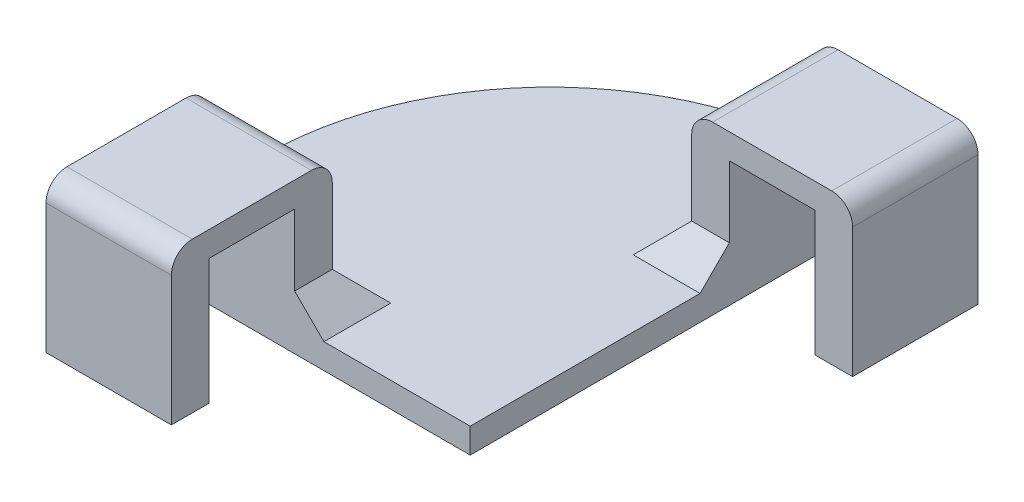
ISO-10303-21;
HEADER;
FILE_DESCRIPTION(('STEP AP214'),'2;1');
FILE_NAME('part.step','',(''),(''),'','','');
FILE_SCHEMA(('AUTOMOTIVE_DESIGN { 1 0 10303 214 1 1 1 1 }'));
ENDSEC;
DATA;
#1=APPLICATION_CONTEXT('core data for automotive mechanical design processes');
#2=APPLICATION_PROTOCOL_DEFINITION('international standard','automotive_design',2000,#1);
#3=PRODUCT_CONTEXT('',#1,'mechanical');
#4=PRODUCT('Part','Part','',(#3));
#5=PRODUCT_RELATED_PRODUCT_CATEGORY('part','',(#4));
#6=PRODUCT_DEFINITION_FORMATION('','',#4);
#7=PRODUCT_DEFINITION_CONTEXT('part definition',#1,'design');
#8=PRODUCT_DEFINITION('design','',#6,#7);
#9=PRODUCT_DEFINITION_SHAPE('','',#8);
#10=(LENGTH_UNIT() NAMED_UNIT(*) SI_UNIT(.MILLI.,.METRE.));
#11=(NAMED_UNIT(*) PLANE_ANGLE_UNIT() SI_UNIT($,.RADIAN.));
#12=(NAMED_UNIT(*) SI_UNIT($,.STERADIAN.) SOLID_ANGLE_UNIT());
#13=UNCERTAINTY_MEASURE_WITH_UNIT(LENGTH_MEASURE(1.E-05),#10,'distance_accuracy_value','');
#14=(GEOMETRIC_REPRESENTATION_CONTEXT(3) GLOBAL_UNCERTAINTY_ASSIGNED_CONTEXT((#13)) GLOBAL_UNIT_ASSIGNED_CONTEXT((#10,
#11,#12)) REPRESENTATION_CONTEXT('',''));
#15=CARTESIAN_POINT('',(0.,0.,0.));
#16=DIRECTION('',(0.,0.,1.));
#17=DIRECTION('',(1.,0.,0.));
#18=AXIS2_PLACEMENT_3D('',#15,#16,#17);
#19=CARTESIAN_POINT('',(0.,30.,0.));
#20=DIRECTION('',(0.,-1.,0.));
#21=DIRECTION('',(0.,0.,-1.));
#22=AXIS2_PLACEMENT_3D('',#19,#20,#21);
#23=PLANE('',#22);
#24=DIRECTION('',(1.,0.,0.));
#25=VECTOR('',#24,1.);
#26=CARTESIAN_POINT('',(1.41861830924324E-13,30.,-91.9999999999999));
#27=LINE('',#26,#25);
#28=CARTESIAN_POINT('',(0.,30.,-91.9999999999999));
#29=VERTEX_POINT('',#28);
#30=CARTESIAN_POINT('',(20.5000000000001,30.,-91.9999999999999));
#31=VERTEX_POINT('',#30);
#32=EDGE_CURVE('E271',#29,#31,#27,.T.);
#33=ORIENTED_EDGE('',*,*,#32,.T.);
#34=DIRECTION('',(0.,0.,-1.));
#35=VECTOR('',#34,1.);
#36=CARTESIAN_POINT('',(20.5000000000001,30.,0.));
#37=LINE('',#36,#35);
#38=CARTESIAN_POINT('',(20.5000000000001,30.,-62.0000000000001));
#39=VERTEX_POINT('',#38);
#40=EDGE_CURVE('E413',#39,#31,#37,.T.);
#41=ORIENTED_EDGE('',*,*,#40,.F.);
#42=DIRECTION('',(1.,0.,0.));
#43=VECTOR('',#42,1.);
#44=CARTESIAN_POINT('',(-3.8241015292644E-13,30.,-62.));
#45=LINE('',#44,#43);
#46=CARTESIAN_POINT('',(0.,30.,-62.));
#47=VERTEX_POINT('',#46);
#48=EDGE_CURVE('E280',#47,#39,#45,.T.);
#49=ORIENTED_EDGE('',*,*,#48,.F.);
#50=DIRECTION('',(0.,0.,-1.));
#51=VECTOR('',#50,1.);
#52=CARTESIAN_POINT('',(0.,30.,0.));
#53=LINE('',#52,#51);
#54=EDGE_CURVE('E302',#47,#29,#53,.T.);
#55=ORIENTED_EDGE('',*,*,#54,.T.);
#56=EDGE_LOOP('',(#33,#41,#49,#55));
#57=FACE_BOUND('',#56,.T.);
#58=ADVANCED_FACE('F35',(#57),#23,.T.);
#59=CARTESIAN_POINT('',(0.,6.,0.));
#60=DIRECTION('',(0.,0.,1.));
#61=DIRECTION('',(1.,0.,0.));
#62=AXIS2_PLACEMENT_3D('',#59,#60,#61);
#63=PLANE('',#62);
#64=DIRECTION('',(-1.,0.,0.));
#65=VECTOR('',#64,1.);
#66=CARTESIAN_POINT('',(0.,0.,0.));
#67=LINE('',#66,#65);
#68=CARTESIAN_POINT('',(0.,0.,0.));
#69=VERTEX_POINT('',#68);
#70=CARTESIAN_POINT('',(-80.7745184235845,0.,0.));
#71=VERTEX_POINT('',#70);
#72=EDGE_CURVE('E329',#69,#71,#67,.T.);
#73=ORIENTED_EDGE('',*,*,#72,.F.);
#74=DIRECTION('',(0.,-1.,0.));
#75=VECTOR('',#74,1.);
#76=CARTESIAN_POINT('',(0.,6.,0.));
#77=LINE('',#76,#75);
#78=CARTESIAN_POINT('',(0.,6.,0.));
#79=VERTEX_POINT('',#78);
#80=EDGE_CURVE('E367',#79,#69,#77,.T.);
#81=ORIENTED_EDGE('',*,*,#80,.F.);
#82=DIRECTION('',(-1.,0.,0.));
#83=VECTOR('',#82,1.);
#84=CARTESIAN_POINT('',(0.,6.,0.));
#85=LINE('',#84,#83);
#86=CARTESIAN_POINT('',(-34.9999999999999,6.,0.));
#87=VERTEX_POINT('',#86);
#88=EDGE_CURVE('E330',#79,#87,#85,.T.);
#89=ORIENTED_EDGE('',*,*,#88,.T.);
#90=DIRECTION('',(-0.707106781186553,0.707106781186543,0.));
#91=VECTOR('',#90,1.);
#92=CARTESIAN_POINT('',(-41.9999999999999,13.,0.));
#93=LINE('',#92,#91);
#94=CARTESIAN_POINT('',(-41.9999999999999,13.,0.));
#95=VERTEX_POINT('',#94);
#96=EDGE_CURVE('E397',#87,#95,#93,.T.);
#97=ORIENTED_EDGE('',*,*,#96,.T.);
#98=DIRECTION('',(0.,-1.,0.));
#99=VECTOR('',#98,1.);
#100=CARTESIAN_POINT('',(-41.9999999999999,30.,0.));
#101=LINE('',#100,#99);
#102=CARTESIAN_POINT('',(-41.9999999999999,30.,0.));
#103=VERTEX_POINT('',#102);
#104=EDGE_CURVE('E319',#103,#95,#101,.T.);
#105=ORIENTED_EDGE('',*,*,#104,.F.);
#106=DIRECTION('',(1.,0.,0.));
#107=VECTOR('',#106,1.);
#108=CARTESIAN_POINT('',(0.,30.,0.));
#109=LINE('',#108,#107);
#110=CARTESIAN_POINT('',(-71.9999999999999,30.,1.16573417585641E-13));
#111=VERTEX_POINT('',#110);
#112=EDGE_CURVE('E310',#111,#103,#109,.T.);
#113=ORIENTED_EDGE('',*,*,#112,.F.);
#114=DIRECTION('',(0.,-1.,0.));
#115=VECTOR('',#114,1.);
#116=CARTESIAN_POINT('',(-71.9999999999999,30.,1.16573417585641E-13));
#117=LINE('',#116,#115);
#118=CARTESIAN_POINT('',(-71.9999999999999,13.,1.16573417585641E-13));
#119=VERTEX_POINT('',#118);
#120=EDGE_CURVE('E322',#111,#119,#117,.T.);
#121=ORIENTED_EDGE('',*,*,#120,.T.);
#122=DIRECTION('',(0.707106781186553,0.707106781186543,0.));
#123=VECTOR('',#122,1.);
#124=CARTESIAN_POINT('',(-79.,6.,0.));
#125=LINE('',#124,#123);
#126=CARTESIAN_POINT('',(-79.,6.,1.27906944295357E-13));
#127=VERTEX_POINT('',#126);
#128=EDGE_CURVE('E399',#119,#127,#125,.F.);
#129=ORIENTED_EDGE('',*,*,#128,.T.);
#130=CARTESIAN_POINT('',(-80.7745184235845,6.,0.));
#131=VERTEX_POINT('',#130);
#132=EDGE_CURVE('E334',#127,#131,#85,.T.);
#133=ORIENTED_EDGE('',*,*,#132,.T.);
#134=DIRECTION('',(0.,-1.,0.));
#135=VECTOR('',#134,1.);
#136=CARTESIAN_POINT('',(-80.7745184235845,6.,0.));
#137=LINE('',#136,#135);
#138=EDGE_CURVE('E345',#131,#71,#137,.T.);
#139=ORIENTED_EDGE('',*,*,#138,.T.);
#140=EDGE_LOOP('',(#73,#81,#89,#97,#105,#113,#121,#129,#133,#139));
#141=FACE_BOUND('',#140,.T.);
#142=ADVANCED_FACE('F475',(#141),#63,.T.);
#143=CARTESIAN_POINT('',(0.,6.,0.));
#144=DIRECTION('',(1.,0.,0.));
#145=DIRECTION('',(0.,0.,-1.));
#146=AXIS2_PLACEMENT_3D('',#143,#144,#145);
#147=PLANE('',#146);
#148=DIRECTION('',(0.,0.,1.));
#149=VECTOR('',#148,1.);
#150=CARTESIAN_POINT('',(0.,0.,0.));
#151=LINE('',#150,#149);
#152=CARTESIAN_POINT('',(-8.88433427748294E-13,0.,-99.8961122133487));
#153=VERTEX_POINT('',#152);
#154=EDGE_CURVE('E348',#153,#69,#151,.T.);
#155=ORIENTED_EDGE('',*,*,#154,.F.);
#156=DIRECTION('',(0.,-1.,0.));
#157=VECTOR('',#156,1.);
#158=CARTESIAN_POINT('',(-8.88433427748294E-13,6.,-99.8961122133487));
#159=LINE('',#158,#157);
#160=CARTESIAN_POINT('',(-8.88433427748294E-13,6.,-99.8961122133487));
#161=VERTEX_POINT('',#160);
#162=EDGE_CURVE('E365',#161,#153,#159,.T.);
#163=ORIENTED_EDGE('',*,*,#162,.F.);
#164=DIRECTION('',(0.,0.,1.));
#165=VECTOR('',#164,1.);
#166=CARTESIAN_POINT('',(0.,6.,0.));
#167=LINE('',#166,#165);
#168=CARTESIAN_POINT('',(-8.80463787812235E-13,6.,-99.));
#169=VERTEX_POINT('',#168);
#170=EDGE_CURVE('E335',#161,#169,#167,.T.);
#171=ORIENTED_EDGE('',*,*,#170,.T.);
#172=DIRECTION('',(0.,0.707106781186543,0.707106781186552));
#173=VECTOR('',#172,1.);
#174=CARTESIAN_POINT('',(1.41861830924324E-13,12.9999999999999,-91.9999999999999));
#175=LINE('',#174,#173);
#176=CARTESIAN_POINT('',(0.,12.9999999999999,-91.9999999999999));
#177=VERTEX_POINT('',#176);
#178=EDGE_CURVE('E401',#169,#177,#175,.T.);
#179=ORIENTED_EDGE('',*,*,#178,.T.);
#180=DIRECTION('',(0.,-1.,0.));
#181=VECTOR('',#180,1.);
#182=CARTESIAN_POINT('',(0.,30.,-91.9999999999999));
#183=LINE('',#182,#181);
#184=EDGE_CURVE('E311',#29,#177,#183,.T.);
#185=ORIENTED_EDGE('',*,*,#184,.F.);
#186=ORIENTED_EDGE('',*,*,#54,.F.);
#187=DIRECTION('',(0.,-1.,0.));
#188=VECTOR('',#187,1.);
#189=CARTESIAN_POINT('',(0.,30.,-62.));
#190=LINE('',#189,#188);
#191=CARTESIAN_POINT('',(0.,12.9999999999999,-62.));
#192=VERTEX_POINT('',#191);
#193=EDGE_CURVE('E307',#47,#192,#190,.T.);
#194=ORIENTED_EDGE('',*,*,#193,.T.);
#195=DIRECTION('',(0.,0.707106781186543,-0.707106781186552));
#196=VECTOR('',#195,1.);
#197=CARTESIAN_POINT('',(-3.39234813079906E-13,6.,-55.));
#198=LINE('',#197,#196);
#199=CARTESIAN_POINT('',(-4.89146548784575E-13,6.,-55.));
#200=VERTEX_POINT('',#199);
#201=EDGE_CURVE('E403',#192,#200,#198,.F.);
#202=ORIENTED_EDGE('',*,*,#201,.T.);
#203=EDGE_CURVE('E333',#200,#79,#167,.T.);
#204=ORIENTED_EDGE('',*,*,#203,.T.);
#205=ORIENTED_EDGE('',*,*,#80,.T.);
#206=EDGE_LOOP('',(#155,#163,#171,#179,#185,#186,#194,#202,#204,#205));
#207=FACE_BOUND('',#206,.T.);
#208=ADVANCED_FACE('F532',(#207),#147,.T.);
#209=CARTESIAN_POINT('',(0.,6.,-99.8961122133487));
#210=DIRECTION('',(0.,0.,1.));
#211=DIRECTION('',(1.,0.,0.));
#212=AXIS2_PLACEMENT_3D('',#209,#210,#211);
#213=PLANE('',#212);
#214=DIRECTION('',(-1.,0.,0.));
#215=VECTOR('',#214,1.);
#216=CARTESIAN_POINT('',(0.,0.,-99.8961122133487));
#217=LINE('',#216,#215);
#218=CARTESIAN_POINT('',(-12.2462883303985,0.,-99.8961122133487));
#219=VERTEX_POINT('',#218);
#220=EDGE_CURVE('E351',#153,#219,#217,.T.);
#221=ORIENTED_EDGE('',*,*,#220,.T.);
#222=DIRECTION('',(0.,-1.,0.));
#223=VECTOR('',#222,1.);
#224=CARTESIAN_POINT('',(-12.2462883303985,6.,-99.8961122133487));
#225=LINE('',#224,#223);
#226=CARTESIAN_POINT('',(-12.2462883303985,6.,-99.8961122133487));
#227=VERTEX_POINT('',#226);
#228=EDGE_CURVE('E362',#227,#219,#225,.T.);
#229=ORIENTED_EDGE('',*,*,#228,.F.);
#230=DIRECTION('',(-1.,0.,0.));
#231=VECTOR('',#230,1.);
#232=CARTESIAN_POINT('',(0.,6.,-99.8961122133487));
#233=LINE('',#232,#231);
#234=EDGE_CURVE('E338',#161,#227,#233,.T.);
#235=ORIENTED_EDGE('',*,*,#234,.F.);
#236=ORIENTED_EDGE('',*,*,#162,.T.);
#237=EDGE_LOOP('',(#221,#229,#235,#236));
#238=FACE_BOUND('',#237,.T.);
#239=ADVANCED_FACE('F606',(#238),#213,.F.);
#240=CARTESIAN_POINT('',(-12.2462883303985,6.,-31.3678821201627));
#241=DIRECTION('',(0.,-1.,0.));
#242=DIRECTION('',(0.,0.,-1.));
#243=AXIS2_PLACEMENT_3D('',#240,#241,#242);
#244=CYLINDRICAL_SURFACE('',#243,68.528230093186);
#245=CARTESIAN_POINT('',(-12.2462883303985,0.,-31.3678821201627));
#246=DIRECTION('',(0.,1.,0.));
#247=DIRECTION('',(0.,0.,1.));
#248=AXIS2_PLACEMENT_3D('',#245,#246,#247);
#249=CIRCLE('',#248,68.528230093186);
#250=CARTESIAN_POINT('',(-80.7745184235845,0.,-31.3678821201627));
#251=VERTEX_POINT('',#250);
#252=EDGE_CURVE('E353',#219,#251,#249,.T.);
#253=ORIENTED_EDGE('',*,*,#252,.T.);
#254=DIRECTION('',(0.,-1.,0.));
#255=VECTOR('',#254,1.);
#256=CARTESIAN_POINT('',(-80.7745184235845,6.,-31.3678821201627));
#257=LINE('',#256,#255);
#258=CARTESIAN_POINT('',(-80.7745184235845,6.,-31.3678821201627));
#259=VERTEX_POINT('',#258);
#260=EDGE_CURVE('E360',#259,#251,#257,.T.);
#261=ORIENTED_EDGE('',*,*,#260,.F.);
#262=CARTESIAN_POINT('',(-12.2462883303985,6.,-31.3678821201627));
#263=DIRECTION('',(0.,1.,0.));
#264=DIRECTION('',(0.,0.,1.));
#265=AXIS2_PLACEMENT_3D('',#262,#263,#264);
#266=CIRCLE('',#265,68.528230093186);
#267=EDGE_CURVE('E340',#227,#259,#266,.T.);
#268=ORIENTED_EDGE('',*,*,#267,.F.);
#269=ORIENTED_EDGE('',*,*,#228,.T.);
#270=EDGE_LOOP('',(#253,#261,#268,#269));
#271=FACE_BOUND('',#270,.T.);
#272=ADVANCED_FACE('F603',(#271),#244,.T.);
#273=CARTESIAN_POINT('',(-80.7745184235845,6.,0.));
#274=DIRECTION('',(-1.,0.,0.));
#275=DIRECTION('',(0.,0.,1.));
#276=AXIS2_PLACEMENT_3D('',#273,#274,#275);
#277=PLANE('',#276);
#278=DIRECTION('',(0.,0.,-1.));
#279=VECTOR('',#278,1.);
#280=CARTESIAN_POINT('',(-80.7745184235845,0.,0.));
#281=LINE('',#280,#279);
#282=EDGE_CURVE('E356',#71,#251,#281,.T.);
#283=ORIENTED_EDGE('',*,*,#282,.F.);
#284=ORIENTED_EDGE('',*,*,#138,.F.);
#285=DIRECTION('',(0.,0.,-1.));
#286=VECTOR('',#285,1.);
#287=CARTESIAN_POINT('',(-80.7745184235845,6.,0.));
#288=LINE('',#287,#286);
#289=EDGE_CURVE('E342',#131,#259,#288,.T.);
#290=ORIENTED_EDGE('',*,*,#289,.T.);
#291=ORIENTED_EDGE('',*,*,#260,.T.);
#292=EDGE_LOOP('',(#283,#284,#290,#291));
#293=FACE_BOUND('',#292,.T.);
#294=ADVANCED_FACE('F506',(#293),#277,.T.);
#295=CARTESIAN_POINT('',(0.,6.,0.));
#296=DIRECTION('',(0.,1.,0.));
#297=DIRECTION('',(0.,0.,1.));
#298=AXIS2_PLACEMENT_3D('',#295,#296,#297);
#299=PLANE('',#298);
#300=DIRECTION('',(1.,0.,0.));
#301=VECTOR('',#300,1.);
#302=CARTESIAN_POINT('',(-41.9999999999999,6.,-16.0000000000001));
#303=LINE('',#302,#301);
#304=CARTESIAN_POINT('',(-79.,6.,-16.0000000000001));
#305=VERTEX_POINT('',#304);
#306=CARTESIAN_POINT('',(-34.9999999999999,6.,-16.0000000000001));
#307=VERTEX_POINT('',#306);
#308=EDGE_CURVE('E378',#305,#307,#303,.T.);
#309=ORIENTED_EDGE('',*,*,#308,.T.);
#310=DIRECTION('',(0.,0.,1.));
#311=VECTOR('',#310,1.);
#312=CARTESIAN_POINT('',(-34.9999999999999,6.,0.));
#313=LINE('',#312,#311);
#314=EDGE_CURVE('E382',#307,#87,#313,.T.);
#315=ORIENTED_EDGE('',*,*,#314,.T.);
#316=ORIENTED_EDGE('',*,*,#88,.F.);
#317=ORIENTED_EDGE('',*,*,#203,.F.);
#318=DIRECTION('',(-1.,0.,0.));
#319=VECTOR('',#318,1.);
#320=CARTESIAN_POINT('',(-8.99999999999996,6.,-54.9999999999999));
#321=LINE('',#320,#319);
#322=CARTESIAN_POINT('',(-16.,6.,-54.9999999999999));
#323=VERTEX_POINT('',#322);
#324=EDGE_CURVE('E372',#200,#323,#321,.T.);
#325=ORIENTED_EDGE('',*,*,#324,.T.);
#326=DIRECTION('',(0.,0.,-1.));
#327=VECTOR('',#326,1.);
#328=CARTESIAN_POINT('',(-16.,6.,-91.9999999999999));
#329=LINE('',#328,#327);
#330=CARTESIAN_POINT('',(-16.,6.,-99.));
#331=VERTEX_POINT('',#330);
#332=EDGE_CURVE('E374',#323,#331,#329,.T.);
#333=ORIENTED_EDGE('',*,*,#332,.T.);
#334=DIRECTION('',(1.,0.,0.));
#335=VECTOR('',#334,1.);
#336=CARTESIAN_POINT('',(1.52655665885958E-13,6.,-99.));
#337=LINE('',#336,#335);
#338=EDGE_CURVE('E376',#331,#169,#337,.T.);
#339=ORIENTED_EDGE('',*,*,#338,.T.);
#340=ORIENTED_EDGE('',*,*,#170,.F.);
#341=ORIENTED_EDGE('',*,*,#234,.T.);
#342=ORIENTED_EDGE('',*,*,#267,.T.);
#343=ORIENTED_EDGE('',*,*,#289,.F.);
#344=ORIENTED_EDGE('',*,*,#132,.F.);
#345=DIRECTION('',(0.,0.,-1.));
#346=VECTOR('',#345,1.);
#347=CARTESIAN_POINT('',(-79.,6.,-8.99999999999999));
#348=LINE('',#347,#346);
#349=EDGE_CURVE('E380',#127,#305,#348,.T.);
#350=ORIENTED_EDGE('',*,*,#349,.T.);
#351=EDGE_LOOP('',(#309,#315,#316,#317,#325,#333,#339,#340,#341,#342,#343,#344,#350));
#352=FACE_BOUND('',#351,.T.);
#353=ADVANCED_FACE('F500',(#352),#299,.T.);
#354=CARTESIAN_POINT('',(0.,0.,0.));
#355=DIRECTION('',(0.,1.,0.));
#356=DIRECTION('',(0.,0.,1.));
#357=AXIS2_PLACEMENT_3D('',#354,#355,#356);
#358=PLANE('',#357);
#359=ORIENTED_EDGE('',*,*,#72,.T.);
#360=ORIENTED_EDGE('',*,*,#282,.T.);
#361=ORIENTED_EDGE('',*,*,#252,.F.);
#362=ORIENTED_EDGE('',*,*,#220,.F.);
#363=ORIENTED_EDGE('',*,*,#154,.T.);
#364=EDGE_LOOP('',(#359,#360,#361,#362,#363));
#365=FACE_BOUND('',#364,.T.);
#366=ADVANCED_FACE('F510',(#365),#358,.F.);
#367=CARTESIAN_POINT('',(-41.9999999999999,30.,0.));
#368=DIRECTION('',(-1.,0.,0.));
#369=DIRECTION('',(0.,0.,1.));
#370=AXIS2_PLACEMENT_3D('',#367,#368,#369);
#371=PLANE('',#370);
#372=DIRECTION('',(0.,0.,1.));
#373=VECTOR('',#372,1.);
#374=CARTESIAN_POINT('',(-41.9999999999999,36.,0.));
#375=LINE('',#374,#373);
#376=CARTESIAN_POINT('',(-41.9999999999999,36.,-3.99999999999999));
#377=VERTEX_POINT('',#376);
#378=CARTESIAN_POINT('',(-42.,36.,24.5));
#379=VERTEX_POINT('',#378);
#380=EDGE_CURVE('E288',#377,#379,#375,.T.);
#381=ORIENTED_EDGE('',*,*,#380,.T.);
#382=CARTESIAN_POINT('',(-42.,31.,24.5));
#383=DIRECTION('',(-1.,0.,0.));
#384=DIRECTION('',(0.,0.,1.));
#385=AXIS2_PLACEMENT_3D('',#382,#383,#384);
#386=CIRCLE('',#385,5.);
#387=CARTESIAN_POINT('',(-42.,31.,29.5));
#388=VERTEX_POINT('',#387);
#389=EDGE_CURVE('E442',#379,#388,#386,.F.);
#390=ORIENTED_EDGE('',*,*,#389,.T.);
#391=DIRECTION('',(0.,-1.,0.));
#392=VECTOR('',#391,1.);
#393=CARTESIAN_POINT('',(-42.,36.,29.5));
#394=LINE('',#393,#392);
#395=CARTESIAN_POINT('',(-41.9999999999999,0.,29.5));
#396=VERTEX_POINT('',#395);
#397=EDGE_CURVE('E295',#388,#396,#394,.T.);
#398=ORIENTED_EDGE('',*,*,#397,.T.);
#399=DIRECTION('',(0.,0.,1.));
#400=VECTOR('',#399,1.);
#401=CARTESIAN_POINT('',(-42.,0.,1.29526019539602E-13));
#402=LINE('',#401,#400);
#403=CARTESIAN_POINT('',(-41.9999999999999,0.,20.5));
#404=VERTEX_POINT('',#403);
#405=EDGE_CURVE('E263',#404,#396,#402,.T.);
#406=ORIENTED_EDGE('',*,*,#405,.F.);
#407=DIRECTION('',(0.,1.,0.));
#408=VECTOR('',#407,1.);
#409=CARTESIAN_POINT('',(-41.9999999999999,-31.3209195267317,20.5));
#410=LINE('',#409,#408);
#411=CARTESIAN_POINT('',(-41.9999999999999,30.,20.5));
#412=VERTEX_POINT('',#411);
#413=EDGE_CURVE('E257',#404,#412,#410,.T.);
#414=ORIENTED_EDGE('',*,*,#413,.T.);
#415=DIRECTION('',(0.,0.,1.));
#416=VECTOR('',#415,1.);
#417=CARTESIAN_POINT('',(-41.9999999999999,30.,0.));
#418=LINE('',#417,#416);
#419=EDGE_CURVE('E286',#103,#412,#418,.T.);
#420=ORIENTED_EDGE('',*,*,#419,.F.);
#421=ORIENTED_EDGE('',*,*,#104,.T.);
#422=DIRECTION('',(0.,0.,-1.));
#423=VECTOR('',#422,1.);
#424=CARTESIAN_POINT('',(-41.9999999999999,13.,0.));
#425=LINE('',#424,#423);
#426=CARTESIAN_POINT('',(-41.9999999999999,13.,-8.99999999999999));
#427=VERTEX_POINT('',#426);
#428=EDGE_CURVE('E369',#95,#427,#425,.T.);
#429=ORIENTED_EDGE('',*,*,#428,.T.);
#430=DIRECTION('',(0.,-1.,0.));
#431=VECTOR('',#430,1.);
#432=CARTESIAN_POINT('',(-41.9999999999999,30.,-8.99999999999999));
#433=LINE('',#432,#431);
#434=CARTESIAN_POINT('',(-41.9999999999999,31.,-8.99999999999999));
#435=VERTEX_POINT('',#434);
#436=EDGE_CURVE('E327',#435,#427,#433,.T.);
#437=ORIENTED_EDGE('',*,*,#436,.F.);
#438=CARTESIAN_POINT('',(-41.9999999999999,31.,-3.99999999999999));
#439=DIRECTION('',(-1.,0.,0.));
#440=DIRECTION('',(0.,0.,1.));
#441=AXIS2_PLACEMENT_3D('',#438,#439,#440);
#442=CIRCLE('',#441,5.);
#443=EDGE_CURVE('E440',#435,#377,#442,.F.);
#444=ORIENTED_EDGE('',*,*,#443,.T.);
#445=EDGE_LOOP('',(#381,#390,#398,#406,#414,#420,#421,#429,#437,#444));
#446=FACE_BOUND('',#445,.T.);
#447=ADVANCED_FACE('F455',(#446),#371,.F.);
#448=CARTESIAN_POINT('',(0.,30.,-9.));
#449=DIRECTION('',(0.,0.,-1.));
#450=DIRECTION('',(-1.,0.,0.));
#451=AXIS2_PLACEMENT_3D('',#448,#449,#450);
#452=PLANE('',#451);
#453=DIRECTION('',(0.,-1.,0.));
#454=VECTOR('',#453,1.);
#455=CARTESIAN_POINT('',(-71.9999999999999,30.,-8.99999999999999));
#456=LINE('',#455,#454);
#457=CARTESIAN_POINT('',(-71.9999999999999,31.,-8.99999999999999));
#458=VERTEX_POINT('',#457);
#459=CARTESIAN_POINT('',(-71.9999999999999,13.,-8.99999999999999));
#460=VERTEX_POINT('',#459);
#461=EDGE_CURVE('E325',#458,#460,#456,.T.);
#462=ORIENTED_EDGE('',*,*,#461,.F.);
#463=DIRECTION('',(-1.,0.,0.));
#464=VECTOR('',#463,1.);
#465=CARTESIAN_POINT('',(0.,31.,-9.));
#466=LINE('',#465,#464);
#467=EDGE_CURVE('E11',#458,#435,#466,.F.);
#468=ORIENTED_EDGE('',*,*,#467,.T.);
#469=ORIENTED_EDGE('',*,*,#436,.T.);
#470=DIRECTION('',(-1.,0.,0.));
#471=VECTOR('',#470,1.);
#472=CARTESIAN_POINT('',(-71.9999999999999,13.,-8.99999999999999));
#473=LINE('',#472,#471);
#474=EDGE_CURVE('E386',#427,#460,#473,.T.);
#475=ORIENTED_EDGE('',*,*,#474,.T.);
#476=EDGE_LOOP('',(#462,#468,#469,#475));
#477=FACE_BOUND('',#476,.T.);
#478=ADVANCED_FACE('F490',(#477),#452,.T.);
#479=CARTESIAN_POINT('',(-71.9999999999999,30.,0.));
#480=DIRECTION('',(-1.,0.,0.));
#481=DIRECTION('',(0.,0.,1.));
#482=AXIS2_PLACEMENT_3D('',#479,#480,#481);
#483=PLANE('',#482);
#484=DIRECTION('',(0.,-1.,0.));
#485=VECTOR('',#484,1.);
#486=CARTESIAN_POINT('',(-71.9999999999999,36.,29.5000000000001));
#487=LINE('',#486,#485);
#488=CARTESIAN_POINT('',(-71.9999999999999,31.,29.5000000000001));
#489=VERTEX_POINT('',#488);
#490=CARTESIAN_POINT('',(-71.9999999999999,0.,29.5000000000001));
#491=VERTEX_POINT('',#490);
#492=EDGE_CURVE('E300',#489,#491,#487,.T.);
#493=ORIENTED_EDGE('',*,*,#492,.F.);
#494=CARTESIAN_POINT('',(-71.9999999999999,31.,24.5000000000001));
#495=DIRECTION('',(-1.,0.,0.));
#496=DIRECTION('',(0.,0.,1.));
#497=AXIS2_PLACEMENT_3D('',#494,#495,#496);
#498=CIRCLE('',#497,5.);
#499=CARTESIAN_POINT('',(-71.9999999999999,36.,24.5000000000001));
#500=VERTEX_POINT('',#499);
#501=EDGE_CURVE('E43',#489,#500,#498,.T.);
#502=ORIENTED_EDGE('',*,*,#501,.T.);
#503=DIRECTION('',(0.,0.,1.));
#504=VECTOR('',#503,1.);
#505=CARTESIAN_POINT('',(-71.9999999999999,36.,0.));
#506=LINE('',#505,#504);
#507=CARTESIAN_POINT('',(-71.9999999999999,36.,-3.99999999999999));
#508=VERTEX_POINT('',#507);
#509=EDGE_CURVE('E291',#508,#500,#506,.T.);
#510=ORIENTED_EDGE('',*,*,#509,.F.);
#511=CARTESIAN_POINT('',(-71.9999999999999,31.,-3.99999999999999));
#512=DIRECTION('',(-1.,0.,0.));
#513=DIRECTION('',(0.,0.,1.));
#514=AXIS2_PLACEMENT_3D('',#511,#512,#513);
#515=CIRCLE('',#514,5.);
#516=EDGE_CURVE('E50',#508,#458,#515,.T.);
#517=ORIENTED_EDGE('',*,*,#516,.T.);
#518=ORIENTED_EDGE('',*,*,#461,.T.);
#519=DIRECTION('',(0.,0.,1.));
#520=VECTOR('',#519,1.);
#521=CARTESIAN_POINT('',(-71.9999999999999,13.,1.16573417585641E-13));
#522=LINE('',#521,#520);
#523=EDGE_CURVE('E384',#460,#119,#522,.T.);
#524=ORIENTED_EDGE('',*,*,#523,.T.);
#525=ORIENTED_EDGE('',*,*,#120,.F.);
#526=DIRECTION('',(0.,0.,1.));
#527=VECTOR('',#526,1.);
#528=CARTESIAN_POINT('',(-71.9999999999999,30.,0.));
#529=LINE('',#528,#527);
#530=CARTESIAN_POINT('',(-71.9999999999999,30.,20.5));
#531=VERTEX_POINT('',#530);
#532=EDGE_CURVE('E292',#111,#531,#529,.T.);
#533=ORIENTED_EDGE('',*,*,#532,.T.);
#534=DIRECTION('',(0.,1.,0.));
#535=VECTOR('',#534,1.);
#536=CARTESIAN_POINT('',(-71.9999999999999,-31.3209195267317,20.5));
#537=LINE('',#536,#535);
#538=CARTESIAN_POINT('',(-71.9999999999999,0.,20.5));
#539=VERTEX_POINT('',#538);
#540=EDGE_CURVE('E274',#539,#531,#537,.T.);
#541=ORIENTED_EDGE('',*,*,#540,.F.);
#542=DIRECTION('',(0.,0.,1.));
#543=VECTOR('',#542,1.);
#544=CARTESIAN_POINT('',(-71.9999999999999,0.,0.));
#545=LINE('',#544,#543);
#546=EDGE_CURVE('E269',#539,#491,#545,.T.);
#547=ORIENTED_EDGE('',*,*,#546,.T.);
#548=EDGE_LOOP('',(#493,#502,#510,#517,#518,#524,#525,#533,#541,#547));
#549=FACE_BOUND('',#548,.T.);
#550=ADVANCED_FACE('F446',(#549),#483,.T.);
#551=CARTESIAN_POINT('',(-3.8241015292644E-13,30.,-62.));
#552=DIRECTION('',(0.,0.,1.));
#553=DIRECTION('',(1.,0.,0.));
#554=AXIS2_PLACEMENT_3D('',#551,#552,#553);
#555=PLANE('',#554);
#556=DIRECTION('',(0.,-1.,0.));
#557=VECTOR('',#556,1.);
#558=CARTESIAN_POINT('',(29.5000000000001,36.,-62.0000000000002));
#559=LINE('',#558,#557);
#560=CARTESIAN_POINT('',(29.5000000000001,31.,-62.0000000000002));
#561=VERTEX_POINT('',#560);
#562=CARTESIAN_POINT('',(29.5000000000001,0.,-61.9999999999999));
#563=VERTEX_POINT('',#562);
#564=EDGE_CURVE('E239',#561,#563,#559,.T.);
#565=ORIENTED_EDGE('',*,*,#564,.F.);
#566=CARTESIAN_POINT('',(24.5000000000001,31.,-62.0000000000001));
#567=DIRECTION('',(0.,0.,1.));
#568=DIRECTION('',(1.,0.,0.));
#569=AXIS2_PLACEMENT_3D('',#566,#567,#568);
#570=CIRCLE('',#569,5.);
#571=CARTESIAN_POINT('',(24.5000000000001,36.,-62.0000000000001));
#572=VERTEX_POINT('',#571);
#573=EDGE_CURVE('E422',#561,#572,#570,.T.);
#574=ORIENTED_EDGE('',*,*,#573,.T.);
#575=DIRECTION('',(1.,0.,0.));
#576=VECTOR('',#575,1.);
#577=CARTESIAN_POINT('',(-3.8241015292644E-13,36.,-62.));
#578=LINE('',#577,#576);
#579=CARTESIAN_POINT('',(-4.,36.,-62.));
#580=VERTEX_POINT('',#579);
#581=EDGE_CURVE('E240',#580,#572,#578,.T.);
#582=ORIENTED_EDGE('',*,*,#581,.F.);
#583=CARTESIAN_POINT('',(-4.,31.,-62.));
#584=DIRECTION('',(0.,0.,1.));
#585=DIRECTION('',(1.,0.,0.));
#586=AXIS2_PLACEMENT_3D('',#583,#584,#585);
#587=CIRCLE('',#586,5.);
#588=CARTESIAN_POINT('',(-9.,31.,-61.9999999999999));
#589=VERTEX_POINT('',#588);
#590=EDGE_CURVE('E420',#580,#589,#587,.T.);
#591=ORIENTED_EDGE('',*,*,#590,.T.);
#592=DIRECTION('',(0.,-1.,0.));
#593=VECTOR('',#592,1.);
#594=CARTESIAN_POINT('',(-9.,30.,-61.9999999999999));
#595=LINE('',#594,#593);
#596=CARTESIAN_POINT('',(-9.,12.9999999999999,-61.9999999999999));
#597=VERTEX_POINT('',#596);
#598=EDGE_CURVE('E306',#589,#597,#595,.T.);
#599=ORIENTED_EDGE('',*,*,#598,.T.);
#600=DIRECTION('',(1.,0.,0.));
#601=VECTOR('',#600,1.);
#602=CARTESIAN_POINT('',(-5.5140156408443E-13,12.9999999999999,-62.));
#603=LINE('',#602,#601);
#604=EDGE_CURVE('E395',#597,#192,#603,.T.);
#605=ORIENTED_EDGE('',*,*,#604,.T.);
#606=ORIENTED_EDGE('',*,*,#193,.F.);
#607=ORIENTED_EDGE('',*,*,#48,.T.);
#608=DIRECTION('',(0.,1.,0.));
#609=VECTOR('',#608,1.);
#610=CARTESIAN_POINT('',(20.5000000000001,-31.3209195267317,-61.9999999999999));
#611=LINE('',#610,#609);
#612=CARTESIAN_POINT('',(20.5000000000001,0.,-61.9999999999999));
#613=VERTEX_POINT('',#612);
#614=EDGE_CURVE('E249',#613,#39,#611,.T.);
#615=ORIENTED_EDGE('',*,*,#614,.F.);
#616=DIRECTION('',(1.,0.,0.));
#617=VECTOR('',#616,1.);
#618=CARTESIAN_POINT('',(0.,0.,-61.9999999999999));
#619=LINE('',#618,#617);
#620=EDGE_CURVE('E254',#613,#563,#619,.T.);
#621=ORIENTED_EDGE('',*,*,#620,.T.);
#622=EDGE_LOOP('',(#565,#574,#582,#591,#599,#605,#606,#607,#615,#621));
#623=FACE_BOUND('',#622,.T.);
#624=ADVANCED_FACE('F541',(#623),#555,.T.);
#625=CARTESIAN_POINT('',(1.41861830924324E-13,30.,-91.9999999999999));
#626=DIRECTION('',(0.,0.,1.));
#627=DIRECTION('',(1.,0.,0.));
#628=AXIS2_PLACEMENT_3D('',#625,#626,#627);
#629=PLANE('',#628);
#630=DIRECTION('',(1.,0.,0.));
#631=VECTOR('',#630,1.);
#632=CARTESIAN_POINT('',(1.41861830924324E-13,36.,-91.9999999999999));
#633=LINE('',#632,#631);
#634=CARTESIAN_POINT('',(-4.,36.,-91.9999999999999));
#635=VERTEX_POINT('',#634);
#636=CARTESIAN_POINT('',(24.5000000000001,36.,-91.9999999999999));
#637=VERTEX_POINT('',#636);
#638=EDGE_CURVE('E278',#635,#637,#633,.T.);
#639=ORIENTED_EDGE('',*,*,#638,.T.);
#640=CARTESIAN_POINT('',(24.5000000000001,31.,-91.9999999999999));
#641=DIRECTION('',(0.,0.,1.));
#642=DIRECTION('',(1.,0.,0.));
#643=AXIS2_PLACEMENT_3D('',#640,#641,#642);
#644=CIRCLE('',#643,5.);
#645=CARTESIAN_POINT('',(29.5000000000001,31.,-91.9999999999999));
#646=VERTEX_POINT('',#645);
#647=EDGE_CURVE('E234',#637,#646,#644,.F.);
#648=ORIENTED_EDGE('',*,*,#647,.T.);
#649=DIRECTION('',(0.,-1.,0.));
#650=VECTOR('',#649,1.);
#651=CARTESIAN_POINT('',(29.5000000000001,36.,-91.9999999999999));
#652=LINE('',#651,#650);
#653=CARTESIAN_POINT('',(29.5000000000001,0.,-91.9999999999999));
#654=VERTEX_POINT('',#653);
#655=EDGE_CURVE('E226',#646,#654,#652,.T.);
#656=ORIENTED_EDGE('',*,*,#655,.T.);
#657=DIRECTION('',(1.,0.,0.));
#658=VECTOR('',#657,1.);
#659=CARTESIAN_POINT('',(-1.41861830924325E-13,0.,-91.9999999999999));
#660=LINE('',#659,#658);
#661=CARTESIAN_POINT('',(20.5000000000001,0.,-91.9999999999999));
#662=VERTEX_POINT('',#661);
#663=EDGE_CURVE('E231',#662,#654,#660,.T.);
#664=ORIENTED_EDGE('',*,*,#663,.F.);
#665=DIRECTION('',(0.,1.,0.));
#666=VECTOR('',#665,1.);
#667=CARTESIAN_POINT('',(20.5000000000001,-31.3209195267317,-91.9999999999999));
#668=LINE('',#667,#666);
#669=EDGE_CURVE('E536',#662,#31,#668,.T.);
#670=ORIENTED_EDGE('',*,*,#669,.T.);
#671=ORIENTED_EDGE('',*,*,#32,.F.);
#672=ORIENTED_EDGE('',*,*,#184,.T.);
#673=DIRECTION('',(-1.,0.,0.));
#674=VECTOR('',#673,1.);
#675=CARTESIAN_POINT('',(1.41861830924324E-13,12.9999999999999,-91.9999999999999));
#676=LINE('',#675,#674);
#677=CARTESIAN_POINT('',(-9.,12.9999999999999,-91.9999999999999));
#678=VERTEX_POINT('',#677);
#679=EDGE_CURVE('E389',#177,#678,#676,.T.);
#680=ORIENTED_EDGE('',*,*,#679,.T.);
#681=DIRECTION('',(0.,-1.,0.));
#682=VECTOR('',#681,1.);
#683=CARTESIAN_POINT('',(-9.,30.,-91.9999999999999));
#684=LINE('',#683,#682);
#685=CARTESIAN_POINT('',(-9.,31.,-91.9999999999999));
#686=VERTEX_POINT('',#685);
#687=EDGE_CURVE('E314',#686,#678,#684,.T.);
#688=ORIENTED_EDGE('',*,*,#687,.F.);
#689=CARTESIAN_POINT('',(-4.,31.,-91.9999999999999));
#690=DIRECTION('',(0.,0.,1.));
#691=DIRECTION('',(1.,0.,0.));
#692=AXIS2_PLACEMENT_3D('',#689,#690,#691);
#693=CIRCLE('',#692,5.);
#694=EDGE_CURVE('E429',#686,#635,#693,.F.);
#695=ORIENTED_EDGE('',*,*,#694,.T.);
#696=EDGE_LOOP('',(#639,#648,#656,#664,#670,#671,#672,#680,#688,#695));
#697=FACE_BOUND('',#696,.T.);
#698=ADVANCED_FACE('F229',(#697),#629,.F.);
#699=CARTESIAN_POINT('',(-9.,30.,0.));
#700=DIRECTION('',(-1.,0.,0.));
#701=DIRECTION('',(0.,0.,1.));
#702=AXIS2_PLACEMENT_3D('',#699,#700,#701);
#703=PLANE('',#702);
#704=ORIENTED_EDGE('',*,*,#598,.F.);
#705=DIRECTION('',(0.,0.,1.));
#706=VECTOR('',#705,1.);
#707=CARTESIAN_POINT('',(-9.,31.,-91.9999999999999));
#708=LINE('',#707,#706);
#709=EDGE_CURVE('E432',#589,#686,#708,.F.);
#710=ORIENTED_EDGE('',*,*,#709,.T.);
#711=ORIENTED_EDGE('',*,*,#687,.T.);
#712=DIRECTION('',(0.,0.,1.));
#713=VECTOR('',#712,1.);
#714=CARTESIAN_POINT('',(-9.,12.9999999999999,-61.9999999999999));
#715=LINE('',#714,#713);
#716=EDGE_CURVE('E392',#678,#597,#715,.T.);
#717=ORIENTED_EDGE('',*,*,#716,.T.);
#718=EDGE_LOOP('',(#704,#710,#711,#717));
#719=FACE_BOUND('',#718,.T.);
#720=ADVANCED_FACE('F548',(#719),#703,.T.);
#721=CARTESIAN_POINT('',(0.,30.,0.));
#722=DIRECTION('',(0.,1.,0.));
#723=DIRECTION('',(0.,0.,1.));
#724=AXIS2_PLACEMENT_3D('',#721,#722,#723);
#725=PLANE('',#724);
#726=ORIENTED_EDGE('',*,*,#419,.T.);
#727=DIRECTION('',(-1.,0.,0.));
#728=VECTOR('',#727,1.);
#729=CARTESIAN_POINT('',(0.,30.,20.5));
#730=LINE('',#729,#728);
#731=EDGE_CURVE('E253',#412,#531,#730,.T.);
#732=ORIENTED_EDGE('',*,*,#731,.T.);
#733=ORIENTED_EDGE('',*,*,#532,.F.);
#734=ORIENTED_EDGE('',*,*,#112,.T.);
#735=EDGE_LOOP('',(#726,#732,#733,#734));
#736=FACE_BOUND('',#735,.T.);
#737=ADVANCED_FACE('F471',(#736),#725,.F.);
#738=CARTESIAN_POINT('',(0.,36.,29.5));
#739=DIRECTION('',(0.,0.,-1.));
#740=DIRECTION('',(-1.,0.,0.));
#741=AXIS2_PLACEMENT_3D('',#738,#739,#740);
#742=PLANE('',#741);
#743=ORIENTED_EDGE('',*,*,#397,.F.);
#744=DIRECTION('',(1.,0.,0.));
#745=VECTOR('',#744,1.);
#746=CARTESIAN_POINT('',(-71.9999999999999,31.,29.5000000000001));
#747=LINE('',#746,#745);
#748=EDGE_CURVE('E58',#388,#489,#747,.F.);
#749=ORIENTED_EDGE('',*,*,#748,.T.);
#750=ORIENTED_EDGE('',*,*,#492,.T.);
#751=DIRECTION('',(1.,0.,0.));
#752=VECTOR('',#751,1.);
#753=CARTESIAN_POINT('',(0.,0.,29.5));
#754=LINE('',#753,#752);
#755=EDGE_CURVE('E267',#491,#396,#754,.T.);
#756=ORIENTED_EDGE('',*,*,#755,.T.);
#757=EDGE_LOOP('',(#743,#749,#750,#756));
#758=FACE_BOUND('',#757,.T.);
#759=ADVANCED_FACE('F457',(#758),#742,.F.);
#760=CARTESIAN_POINT('',(0.,36.,0.));
#761=DIRECTION('',(0.,1.,0.));
#762=DIRECTION('',(0.,0.,1.));
#763=AXIS2_PLACEMENT_3D('',#760,#761,#762);
#764=PLANE('',#763);
#765=ORIENTED_EDGE('',*,*,#509,.T.);
#766=DIRECTION('',(1.,0.,0.));
#767=VECTOR('',#766,1.);
#768=CARTESIAN_POINT('',(-42.,36.,24.5));
#769=LINE('',#768,#767);
#770=EDGE_CURVE('E437',#500,#379,#769,.T.);
#771=ORIENTED_EDGE('',*,*,#770,.T.);
#772=ORIENTED_EDGE('',*,*,#380,.F.);
#773=DIRECTION('',(-1.,0.,0.));
#774=VECTOR('',#773,1.);
#775=CARTESIAN_POINT('',(0.,36.,-4.));
#776=LINE('',#775,#774);
#777=EDGE_CURVE('E434',#377,#508,#776,.T.);
#778=ORIENTED_EDGE('',*,*,#777,.T.);
#779=EDGE_LOOP('',(#765,#771,#772,#778));
#780=FACE_BOUND('',#779,.T.);
#781=ADVANCED_FACE('F450',(#780),#764,.T.);
#782=CARTESIAN_POINT('',(29.5000000000001,36.,0.));
#783=DIRECTION('',(1.,0.,0.));
#784=DIRECTION('',(0.,0.,-1.));
#785=AXIS2_PLACEMENT_3D('',#782,#783,#784);
#786=PLANE('',#785);
#787=ORIENTED_EDGE('',*,*,#655,.F.);
#788=DIRECTION('',(0.,0.,1.));
#789=VECTOR('',#788,1.);
#790=CARTESIAN_POINT('',(29.5000000000001,31.,-62.0000000000002));
#791=LINE('',#790,#789);
#792=EDGE_CURVE('E405',#646,#561,#791,.T.);
#793=ORIENTED_EDGE('',*,*,#792,.T.);
#794=ORIENTED_EDGE('',*,*,#564,.T.);
#795=DIRECTION('',(0.,0.,1.));
#796=VECTOR('',#795,1.);
#797=CARTESIAN_POINT('',(29.5000000000001,0.,0.));
#798=LINE('',#797,#796);
#799=EDGE_CURVE('E245',#654,#563,#798,.T.);
#800=ORIENTED_EDGE('',*,*,#799,.F.);
#801=EDGE_LOOP('',(#787,#793,#794,#800));
#802=FACE_BOUND('',#801,.T.);
#803=ADVANCED_FACE('F251',(#802),#786,.T.);
#804=CARTESIAN_POINT('',(0.,36.,0.));
#805=DIRECTION('',(0.,-1.,0.));
#806=DIRECTION('',(0.,0.,-1.));
#807=AXIS2_PLACEMENT_3D('',#804,#805,#806);
#808=PLANE('',#807);
#809=ORIENTED_EDGE('',*,*,#581,.T.);
#810=DIRECTION('',(0.,0.,1.));
#811=VECTOR('',#810,1.);
#812=CARTESIAN_POINT('',(24.5000000000001,36.,-91.9999999999999));
#813=LINE('',#812,#811);
#814=EDGE_CURVE('E427',#572,#637,#813,.F.);
#815=ORIENTED_EDGE('',*,*,#814,.T.);
#816=ORIENTED_EDGE('',*,*,#638,.F.);
#817=DIRECTION('',(0.,0.,1.));
#818=VECTOR('',#817,1.);
#819=CARTESIAN_POINT('',(-4.,36.,-61.9999999999999));
#820=LINE('',#819,#818);
#821=EDGE_CURVE('E424',#635,#580,#820,.T.);
#822=ORIENTED_EDGE('',*,*,#821,.T.);
#823=EDGE_LOOP('',(#809,#815,#816,#822));
#824=FACE_BOUND('',#823,.T.);
#825=ADVANCED_FACE('F555',(#824),#808,.F.);
#826=CARTESIAN_POINT('',(0.,-31.3209195267317,20.5));
#827=DIRECTION('',(0.,0.,-1.));
#828=DIRECTION('',(-1.,0.,0.));
#829=AXIS2_PLACEMENT_3D('',#826,#827,#828);
#830=PLANE('',#829);
#831=DIRECTION('',(1.,0.,0.));
#832=VECTOR('',#831,1.);
#833=CARTESIAN_POINT('',(0.,0.,20.5));
#834=LINE('',#833,#832);
#835=EDGE_CURVE('E266',#539,#404,#834,.T.);
#836=ORIENTED_EDGE('',*,*,#835,.F.);
#837=ORIENTED_EDGE('',*,*,#540,.T.);
#838=ORIENTED_EDGE('',*,*,#731,.F.);
#839=ORIENTED_EDGE('',*,*,#413,.F.);
#840=EDGE_LOOP('',(#836,#837,#838,#839));
#841=FACE_BOUND('',#840,.T.);
#842=ADVANCED_FACE('F467',(#841),#830,.T.);
#843=CARTESIAN_POINT('',(0.,0.,0.));
#844=DIRECTION('',(0.,1.,0.));
#845=DIRECTION('',(0.,0.,1.));
#846=AXIS2_PLACEMENT_3D('',#843,#844,#845);
#847=PLANE('',#846);
#848=ORIENTED_EDGE('',*,*,#835,.T.);
#849=ORIENTED_EDGE('',*,*,#405,.T.);
#850=ORIENTED_EDGE('',*,*,#755,.F.);
#851=ORIENTED_EDGE('',*,*,#546,.F.);
#852=EDGE_LOOP('',(#848,#849,#850,#851));
#853=FACE_BOUND('',#852,.T.);
#854=ADVANCED_FACE('F460',(#853),#847,.F.);
#855=CARTESIAN_POINT('',(20.5000000000001,-31.3209195267317,0.));
#856=DIRECTION('',(1.,0.,0.));
#857=DIRECTION('',(0.,0.,-1.));
#858=AXIS2_PLACEMENT_3D('',#855,#856,#857);
#859=PLANE('',#858);
#860=ORIENTED_EDGE('',*,*,#669,.F.);
#861=DIRECTION('',(0.,0.,1.));
#862=VECTOR('',#861,1.);
#863=CARTESIAN_POINT('',(20.5000000000001,0.,0.));
#864=LINE('',#863,#862);
#865=EDGE_CURVE('E248',#662,#613,#864,.T.);
#866=ORIENTED_EDGE('',*,*,#865,.T.);
#867=ORIENTED_EDGE('',*,*,#614,.T.);
#868=ORIENTED_EDGE('',*,*,#40,.T.);
#869=EDGE_LOOP('',(#860,#866,#867,#868));
#870=FACE_BOUND('',#869,.T.);
#871=ADVANCED_FACE('F763',(#870),#859,.F.);
#872=CARTESIAN_POINT('',(0.,0.,0.));
#873=DIRECTION('',(0.,1.,0.));
#874=DIRECTION('',(0.,0.,1.));
#875=AXIS2_PLACEMENT_3D('',#872,#873,#874);
#876=PLANE('',#875);
#877=ORIENTED_EDGE('',*,*,#865,.F.);
#878=ORIENTED_EDGE('',*,*,#663,.T.);
#879=ORIENTED_EDGE('',*,*,#799,.T.);
#880=ORIENTED_EDGE('',*,*,#620,.F.);
#881=EDGE_LOOP('',(#877,#878,#879,#880));
#882=FACE_BOUND('',#881,.T.);
#883=ADVANCED_FACE('F244',(#882),#876,.F.);
#884=CARTESIAN_POINT('',(-79.,6.,0.));
#885=DIRECTION('',(-0.707106781186543,0.707106781186553,0.));
#886=DIRECTION('',(0.,0.,1.));
#887=AXIS2_PLACEMENT_3D('',#884,#885,#886);
#888=PLANE('',#887);
#889=ORIENTED_EDGE('',*,*,#128,.F.);
#890=ORIENTED_EDGE('',*,*,#523,.F.);
#891=DIRECTION('',(0.577350269189629,0.57735026918962,0.577350269189629));
#892=VECTOR('',#891,1.);
#893=CARTESIAN_POINT('',(-52.6666666666664,32.3333333333332,10.3333333333335));
#894=LINE('',#893,#892);
#895=EDGE_CURVE('E409',#305,#460,#894,.T.);
#896=ORIENTED_EDGE('',*,*,#895,.F.);
#897=ORIENTED_EDGE('',*,*,#349,.F.);
#898=EDGE_LOOP('',(#889,#890,#896,#897));
#899=FACE_BOUND('',#898,.T.);
#900=ADVANCED_FACE('F494',(#899),#888,.T.);
#901=CARTESIAN_POINT('',(0.,6.,-16.0000000000001));
#902=DIRECTION('',(0.,0.707106781186553,-0.707106781186542));
#903=DIRECTION('',(-1.,0.,0.));
#904=AXIS2_PLACEMENT_3D('',#901,#902,#903);
#905=PLANE('',#904);
#906=ORIENTED_EDGE('',*,*,#895,.T.);
#907=ORIENTED_EDGE('',*,*,#474,.F.);
#908=DIRECTION('',(-0.577350269189629,0.57735026918962,0.577350269189628));
#909=VECTOR('',#908,1.);
#910=CARTESIAN_POINT('',(-23.3333333333331,-5.66666666666657,-27.6666666666668));
#911=LINE('',#910,#909);
#912=EDGE_CURVE('E406',#307,#427,#911,.T.);
#913=ORIENTED_EDGE('',*,*,#912,.F.);
#914=ORIENTED_EDGE('',*,*,#308,.F.);
#915=EDGE_LOOP('',(#906,#907,#913,#914));
#916=FACE_BOUND('',#915,.T.);
#917=ADVANCED_FACE('F498',(#916),#905,.T.);
#918=CARTESIAN_POINT('',(-41.9999999999999,13.,0.));
#919=DIRECTION('',(-0.707106781186543,-0.707106781186553,0.));
#920=DIRECTION('',(0.,0.,-1.));
#921=AXIS2_PLACEMENT_3D('',#918,#919,#920);
#922=PLANE('',#921);
#923=ORIENTED_EDGE('',*,*,#96,.F.);
#924=ORIENTED_EDGE('',*,*,#314,.F.);
#925=ORIENTED_EDGE('',*,*,#912,.T.);
#926=ORIENTED_EDGE('',*,*,#428,.F.);
#927=EDGE_LOOP('',(#923,#924,#925,#926));
#928=FACE_BOUND('',#927,.T.);
#929=ADVANCED_FACE('F482',(#928),#922,.F.);
#930=CARTESIAN_POINT('',(-3.39234813079906E-13,6.,-55.));
#931=DIRECTION('',(0.,0.707106781186552,0.707106781186543));
#932=DIRECTION('',(1.,0.,0.));
#933=AXIS2_PLACEMENT_3D('',#930,#931,#932);
#934=PLANE('',#933);
#935=ORIENTED_EDGE('',*,*,#201,.F.);
#936=ORIENTED_EDGE('',*,*,#604,.F.);
#937=DIRECTION('',(-0.577350269189627,-0.57735026918962,0.577350269189631));
#938=VECTOR('',#937,1.);
#939=CARTESIAN_POINT('',(-10.6666666666667,11.3333333333332,-60.3333333333332));
#940=LINE('',#939,#938);
#941=EDGE_CURVE('E410',#323,#597,#940,.F.);
#942=ORIENTED_EDGE('',*,*,#941,.F.);
#943=ORIENTED_EDGE('',*,*,#324,.F.);
#944=EDGE_LOOP('',(#935,#936,#942,#943));
#945=FACE_BOUND('',#944,.T.);
#946=ADVANCED_FACE('F519',(#945),#934,.T.);
#947=CARTESIAN_POINT('',(-16.,6.,0.));
#948=DIRECTION('',(-0.707106781186543,0.707106781186552,0.));
#949=DIRECTION('',(0.,0.,1.));
#950=AXIS2_PLACEMENT_3D('',#947,#948,#949);
#951=PLANE('',#950);
#952=ORIENTED_EDGE('',*,*,#941,.T.);
#953=ORIENTED_EDGE('',*,*,#716,.F.);
#954=DIRECTION('',(0.577350269189628,0.577350269189621,0.57735026918963));
#955=VECTOR('',#954,1.);
#956=CARTESIAN_POINT('',(17.0000000000003,38.9999999999999,-65.9999999999996));
#957=LINE('',#956,#955);
#958=EDGE_CURVE('E414',#331,#678,#957,.T.);
#959=ORIENTED_EDGE('',*,*,#958,.F.);
#960=ORIENTED_EDGE('',*,*,#332,.F.);
#961=EDGE_LOOP('',(#952,#953,#959,#960));
#962=FACE_BOUND('',#961,.T.);
#963=ADVANCED_FACE('F525',(#962),#951,.T.);
#964=CARTESIAN_POINT('',(1.41861830924324E-13,12.9999999999999,-91.9999999999999));
#965=DIRECTION('',(0.,-0.707106781186552,0.707106781186543));
#966=DIRECTION('',(-1.,0.,0.));
#967=AXIS2_PLACEMENT_3D('',#964,#965,#966);
#968=PLANE('',#967);
#969=ORIENTED_EDGE('',*,*,#178,.F.);
#970=ORIENTED_EDGE('',*,*,#338,.F.);
#971=ORIENTED_EDGE('',*,*,#958,.T.);
#972=ORIENTED_EDGE('',*,*,#679,.F.);
#973=EDGE_LOOP('',(#969,#970,#971,#972));
#974=FACE_BOUND('',#973,.T.);
#975=ADVANCED_FACE('F530',(#974),#968,.F.);
#976=CARTESIAN_POINT('',(24.5000000000001,31.,0.));
#977=DIRECTION('',(0.,0.,-1.));
#978=DIRECTION('',(-1.,0.,0.));
#979=AXIS2_PLACEMENT_3D('',#976,#977,#978);
#980=CYLINDRICAL_SURFACE('',#979,5.);
#981=ORIENTED_EDGE('',*,*,#647,.F.);
#982=ORIENTED_EDGE('',*,*,#814,.F.);
#983=ORIENTED_EDGE('',*,*,#573,.F.);
#984=ORIENTED_EDGE('',*,*,#792,.F.);
#985=EDGE_LOOP('',(#981,#982,#983,#984));
#986=FACE_BOUND('',#985,.T.);
#987=ADVANCED_FACE('F558',(#986),#980,.T.);
#988=CARTESIAN_POINT('',(-4.,31.,0.));
#989=DIRECTION('',(0.,0.,-1.));
#990=DIRECTION('',(-1.,0.,0.));
#991=AXIS2_PLACEMENT_3D('',#988,#989,#990);
#992=CYLINDRICAL_SURFACE('',#991,5.);
#993=ORIENTED_EDGE('',*,*,#694,.F.);
#994=ORIENTED_EDGE('',*,*,#709,.F.);
#995=ORIENTED_EDGE('',*,*,#590,.F.);
#996=ORIENTED_EDGE('',*,*,#821,.F.);
#997=EDGE_LOOP('',(#993,#994,#995,#996));
#998=FACE_BOUND('',#997,.T.);
#999=ADVANCED_FACE('F553',(#998),#992,.T.);
#1000=CARTESIAN_POINT('',(0.,31.,24.5));
#1001=DIRECTION('',(-1.,0.,0.));
#1002=DIRECTION('',(0.,0.,1.));
#1003=AXIS2_PLACEMENT_3D('',#1000,#1001,#1002);
#1004=CYLINDRICAL_SURFACE('',#1003,5.);
#1005=ORIENTED_EDGE('',*,*,#501,.F.);
#1006=ORIENTED_EDGE('',*,*,#748,.F.);
#1007=ORIENTED_EDGE('',*,*,#389,.F.);
#1008=ORIENTED_EDGE('',*,*,#770,.F.);
#1009=EDGE_LOOP('',(#1005,#1006,#1007,#1008));
#1010=FACE_BOUND('',#1009,.T.);
#1011=ADVANCED_FACE('F453',(#1010),#1004,.T.);
#1012=CARTESIAN_POINT('',(0.,31.,-4.));
#1013=DIRECTION('',(-1.,0.,0.));
#1014=DIRECTION('',(0.,0.,1.));
#1015=AXIS2_PLACEMENT_3D('',#1012,#1013,#1014);
#1016=CYLINDRICAL_SURFACE('',#1015,5.);
#1017=ORIENTED_EDGE('',*,*,#443,.F.);
#1018=ORIENTED_EDGE('',*,*,#467,.F.);
#1019=ORIENTED_EDGE('',*,*,#516,.F.);
#1020=ORIENTED_EDGE('',*,*,#777,.F.);
#1021=EDGE_LOOP('',(#1017,#1018,#1019,#1020));
#1022=FACE_BOUND('',#1021,.T.);
#1023=ADVANCED_FACE('F37',(#1022),#1016,.T.);
#1024=CLOSED_SHELL('',(#58,#142,#208,#239,#272,#294,#353,#366,#447,#478,#550,#624,#698,#720,
#737,#759,#781,#803,#825,#842,#854,#871,#883,#900,#917,#929,#946,#963,#975,#987,#999,#1011,#1023));
#1025=MANIFOLD_SOLID_BREP('B2',#1024);
#1026=ADVANCED_BREP_SHAPE_REPRESENTATION('',(#18,#1025),#14);
#1027=SHAPE_DEFINITION_REPRESENTATION(#9,#1026);
ENDSEC;
END-ISO-10303-21;
